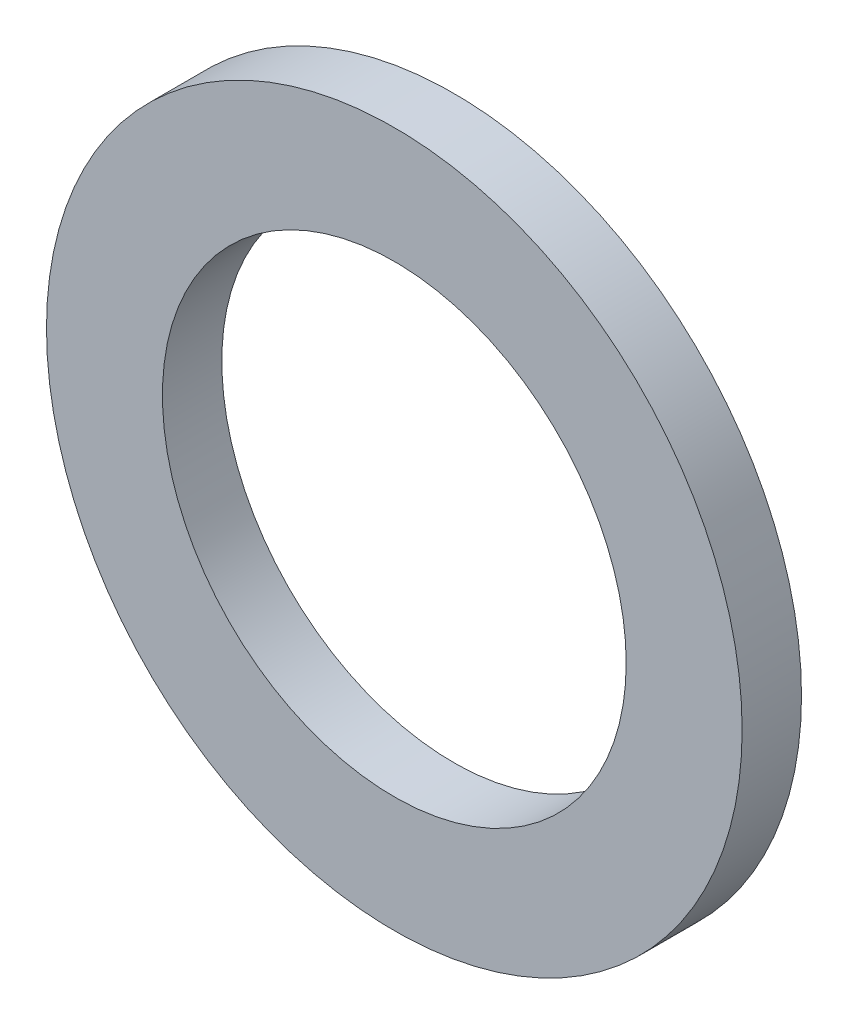
ISO-10303-21;
HEADER;
FILE_DESCRIPTION(('STEP AP214'),'2;1');
FILE_NAME('part.step','',(''),(''),'','','');
FILE_SCHEMA(('AUTOMOTIVE_DESIGN { 1 0 10303 214 1 1 1 1 }'));
ENDSEC;
DATA;
#1=APPLICATION_CONTEXT('core data for automotive mechanical design processes');
#2=APPLICATION_PROTOCOL_DEFINITION('international standard','automotive_design',2000,#1);
#3=PRODUCT_CONTEXT('',#1,'mechanical');
#4=PRODUCT('Part','Part','',(#3));
#5=PRODUCT_RELATED_PRODUCT_CATEGORY('part','',(#4));
#6=PRODUCT_DEFINITION_FORMATION('','',#4);
#7=PRODUCT_DEFINITION_CONTEXT('part definition',#1,'design');
#8=PRODUCT_DEFINITION('design','',#6,#7);
#9=PRODUCT_DEFINITION_SHAPE('','',#8);
#10=(LENGTH_UNIT() NAMED_UNIT(*) SI_UNIT(.MILLI.,.METRE.));
#11=(NAMED_UNIT(*) PLANE_ANGLE_UNIT() SI_UNIT($,.RADIAN.));
#12=(NAMED_UNIT(*) SI_UNIT($,.STERADIAN.) SOLID_ANGLE_UNIT());
#13=UNCERTAINTY_MEASURE_WITH_UNIT(LENGTH_MEASURE(1.E-05),#10,'distance_accuracy_value','');
#14=(GEOMETRIC_REPRESENTATION_CONTEXT(3) GLOBAL_UNCERTAINTY_ASSIGNED_CONTEXT((#13)) GLOBAL_UNIT_ASSIGNED_CONTEXT((#10,
#11,#12)) REPRESENTATION_CONTEXT('',''));
#15=CARTESIAN_POINT('',(0.,0.,0.));
#16=DIRECTION('',(0.,0.,1.));
#17=DIRECTION('',(1.,0.,0.));
#18=AXIS2_PLACEMENT_3D('',#15,#16,#17);
#19=CARTESIAN_POINT('',(0.,0.,0.4064));
#20=DIRECTION('',(0.,0.,1.));
#21=DIRECTION('',(1.,0.,0.));
#22=AXIS2_PLACEMENT_3D('',#19,#20,#21);
#23=PLANE('',#22);
#24=CARTESIAN_POINT('',(0.,0.,0.4064));
#25=DIRECTION('',(0.,0.,1.));
#26=DIRECTION('',(1.,0.,0.));
#27=AXIS2_PLACEMENT_3D('',#24,#25,#26);
#28=CIRCLE('',#27,2.38125);
#29=CARTESIAN_POINT('',(2.38125,0.,0.4064));
#30=VERTEX_POINT('',#29);
#31=EDGE_CURVE('E10',#30,#30,#28,.T.);
#32=ORIENTED_EDGE('',*,*,#31,.T.);
#33=EDGE_LOOP('',(#32));
#34=FACE_BOUND('',#33,.T.);
#35=CARTESIAN_POINT('',(0.,0.,0.4064));
#36=DIRECTION('',(0.,0.,1.));
#37=DIRECTION('',(1.,0.,0.));
#38=AXIS2_PLACEMENT_3D('',#35,#36,#37);
#39=CIRCLE('',#38,1.5875);
#40=CARTESIAN_POINT('',(1.5875,0.,0.4064));
#41=VERTEX_POINT('',#40);
#42=EDGE_CURVE('E45',#41,#41,#39,.T.);
#43=ORIENTED_EDGE('',*,*,#42,.F.);
#44=EDGE_LOOP('',(#43));
#45=FACE_BOUND('',#44,.T.);
#46=ADVANCED_FACE('F34',(#34,#45),#23,.T.);
#47=CARTESIAN_POINT('',(0.,0.,0.));
#48=DIRECTION('',(0.,0.,1.));
#49=DIRECTION('',(1.,0.,0.));
#50=AXIS2_PLACEMENT_3D('',#47,#48,#49);
#51=PLANE('',#50);
#52=CARTESIAN_POINT('',(0.,0.,0.));
#53=DIRECTION('',(0.,0.,1.));
#54=DIRECTION('',(1.,0.,0.));
#55=AXIS2_PLACEMENT_3D('',#52,#53,#54);
#56=CIRCLE('',#55,2.38125);
#57=CARTESIAN_POINT('',(2.38125,0.,0.));
#58=VERTEX_POINT('',#57);
#59=EDGE_CURVE('E38',#58,#58,#56,.T.);
#60=ORIENTED_EDGE('',*,*,#59,.F.);
#61=EDGE_LOOP('',(#60));
#62=FACE_BOUND('',#61,.T.);
#63=CARTESIAN_POINT('',(0.,0.,0.));
#64=DIRECTION('',(0.,0.,1.));
#65=DIRECTION('',(1.,0.,0.));
#66=AXIS2_PLACEMENT_3D('',#63,#64,#65);
#67=CIRCLE('',#66,1.5875);
#68=CARTESIAN_POINT('',(1.5875,0.,0.));
#69=VERTEX_POINT('',#68);
#70=EDGE_CURVE('E47',#69,#69,#67,.T.);
#71=ORIENTED_EDGE('',*,*,#70,.T.);
#72=EDGE_LOOP('',(#71));
#73=FACE_BOUND('',#72,.T.);
#74=ADVANCED_FACE('F57',(#62,#73),#51,.F.);
#75=CARTESIAN_POINT('',(0.,0.,0.4064));
#76=DIRECTION('',(0.,0.,-1.));
#77=DIRECTION('',(-1.,0.,0.));
#78=AXIS2_PLACEMENT_3D('',#75,#76,#77);
#79=CYLINDRICAL_SURFACE('',#78,2.38125);
#80=ORIENTED_EDGE('',*,*,#31,.F.);
#81=EDGE_LOOP('',(#80));
#82=FACE_BOUND('',#81,.T.);
#83=ORIENTED_EDGE('',*,*,#59,.T.);
#84=EDGE_LOOP('',(#83));
#85=FACE_BOUND('',#84,.T.);
#86=ADVANCED_FACE('F36',(#82,#85),#79,.T.);
#87=CARTESIAN_POINT('',(0.,0.,0.4064));
#88=DIRECTION('',(0.,0.,-1.));
#89=DIRECTION('',(-1.,0.,0.));
#90=AXIS2_PLACEMENT_3D('',#87,#88,#89);
#91=CYLINDRICAL_SURFACE('',#90,1.5875);
#92=ORIENTED_EDGE('',*,*,#42,.T.);
#93=EDGE_LOOP('',(#92));
#94=FACE_BOUND('',#93,.T.);
#95=ORIENTED_EDGE('',*,*,#70,.F.);
#96=EDGE_LOOP('',(#95));
#97=FACE_BOUND('',#96,.T.);
#98=ADVANCED_FACE('F53',(#94,#97),#91,.F.);
#99=CLOSED_SHELL('',(#46,#74,#86,#98));
#100=MANIFOLD_SOLID_BREP('B2',#99);
#101=ADVANCED_BREP_SHAPE_REPRESENTATION('',(#18,#100),#14);
#102=SHAPE_DEFINITION_REPRESENTATION(#9,#101);
ENDSEC;
END-ISO-10303-21;
